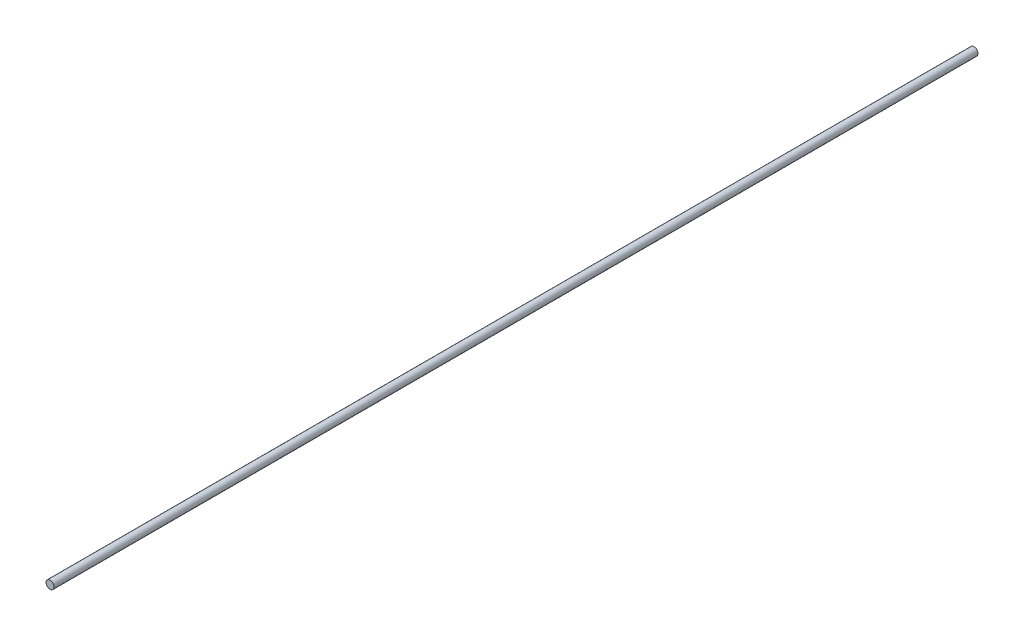
ISO-10303-21;
HEADER;
FILE_DESCRIPTION(('STEP AP214'),'2;1');
FILE_NAME('part.step','',(''),(''),'','','');
FILE_SCHEMA(('AUTOMOTIVE_DESIGN { 1 0 10303 214 1 1 1 1 }'));
ENDSEC;
DATA;
#1=APPLICATION_CONTEXT('core data for automotive mechanical design processes');
#2=APPLICATION_PROTOCOL_DEFINITION('international standard','automotive_design',2000,#1);
#3=PRODUCT_CONTEXT('',#1,'mechanical');
#4=PRODUCT('Part','Part','',(#3));
#5=PRODUCT_RELATED_PRODUCT_CATEGORY('part','',(#4));
#6=PRODUCT_DEFINITION_FORMATION('','',#4);
#7=PRODUCT_DEFINITION_CONTEXT('part definition',#1,'design');
#8=PRODUCT_DEFINITION('design','',#6,#7);
#9=PRODUCT_DEFINITION_SHAPE('','',#8);
#10=(LENGTH_UNIT() NAMED_UNIT(*) SI_UNIT(.MILLI.,.METRE.));
#11=(NAMED_UNIT(*) PLANE_ANGLE_UNIT() SI_UNIT($,.RADIAN.));
#12=(NAMED_UNIT(*) SI_UNIT($,.STERADIAN.) SOLID_ANGLE_UNIT());
#13=UNCERTAINTY_MEASURE_WITH_UNIT(LENGTH_MEASURE(1.E-05),#10,'distance_accuracy_value','');
#14=(GEOMETRIC_REPRESENTATION_CONTEXT(3) GLOBAL_UNCERTAINTY_ASSIGNED_CONTEXT((#13)) GLOBAL_UNIT_ASSIGNED_CONTEXT((#10,
#11,#12)) REPRESENTATION_CONTEXT('',''));
#15=CARTESIAN_POINT('',(0.,0.,0.));
#16=DIRECTION('',(0.,0.,1.));
#17=DIRECTION('',(1.,0.,0.));
#18=AXIS2_PLACEMENT_3D('',#15,#16,#17);
#19=CARTESIAN_POINT('',(0.,0.,914.4));
#20=DIRECTION('',(0.,0.,-1.));
#21=DIRECTION('',(-1.,0.,0.));
#22=AXIS2_PLACEMENT_3D('',#19,#20,#21);
#23=CYLINDRICAL_SURFACE('',#22,7.9375);
#24=CARTESIAN_POINT('',(0.,0.,914.4));
#25=DIRECTION('',(0.,0.,1.));
#26=DIRECTION('',(1.,0.,0.));
#27=AXIS2_PLACEMENT_3D('',#24,#25,#26);
#28=CIRCLE('',#27,7.9375);
#29=CARTESIAN_POINT('',(7.9375,0.,914.4));
#30=VERTEX_POINT('',#29);
#31=EDGE_CURVE('E10',#30,#30,#28,.T.);
#32=ORIENTED_EDGE('',*,*,#31,.F.);
#33=EDGE_LOOP('',(#32));
#34=FACE_BOUND('',#33,.T.);
#35=CARTESIAN_POINT('',(0.,0.,-914.4));
#36=DIRECTION('',(0.,0.,1.));
#37=DIRECTION('',(1.,0.,0.));
#38=AXIS2_PLACEMENT_3D('',#35,#36,#37);
#39=CIRCLE('',#38,7.9375);
#40=CARTESIAN_POINT('',(7.9375,0.,-914.4));
#41=VERTEX_POINT('',#40);
#42=EDGE_CURVE('E35',#41,#41,#39,.T.);
#43=ORIENTED_EDGE('',*,*,#42,.T.);
#44=EDGE_LOOP('',(#43));
#45=FACE_BOUND('',#44,.T.);
#46=ADVANCED_FACE('F32',(#34,#45),#23,.T.);
#47=CARTESIAN_POINT('',(0.,0.,914.4));
#48=DIRECTION('',(0.,0.,1.));
#49=DIRECTION('',(1.,0.,0.));
#50=AXIS2_PLACEMENT_3D('',#47,#48,#49);
#51=PLANE('',#50);
#52=ORIENTED_EDGE('',*,*,#31,.T.);
#53=EDGE_LOOP('',(#52));
#54=FACE_BOUND('',#53,.T.);
#55=ADVANCED_FACE('F47',(#54),#51,.T.);
#56=CARTESIAN_POINT('',(0.,0.,-914.4));
#57=DIRECTION('',(0.,0.,1.));
#58=DIRECTION('',(1.,0.,0.));
#59=AXIS2_PLACEMENT_3D('',#56,#57,#58);
#60=PLANE('',#59);
#61=ORIENTED_EDGE('',*,*,#42,.F.);
#62=EDGE_LOOP('',(#61));
#63=FACE_BOUND('',#62,.T.);
#64=ADVANCED_FACE('F45',(#63),#60,.F.);
#65=CLOSED_SHELL('',(#46,#55,#64));
#66=MANIFOLD_SOLID_BREP('B2',#65);
#67=ADVANCED_BREP_SHAPE_REPRESENTATION('',(#18,#66),#14);
#68=SHAPE_DEFINITION_REPRESENTATION(#9,#67);
ENDSEC;
END-ISO-10303-21;
